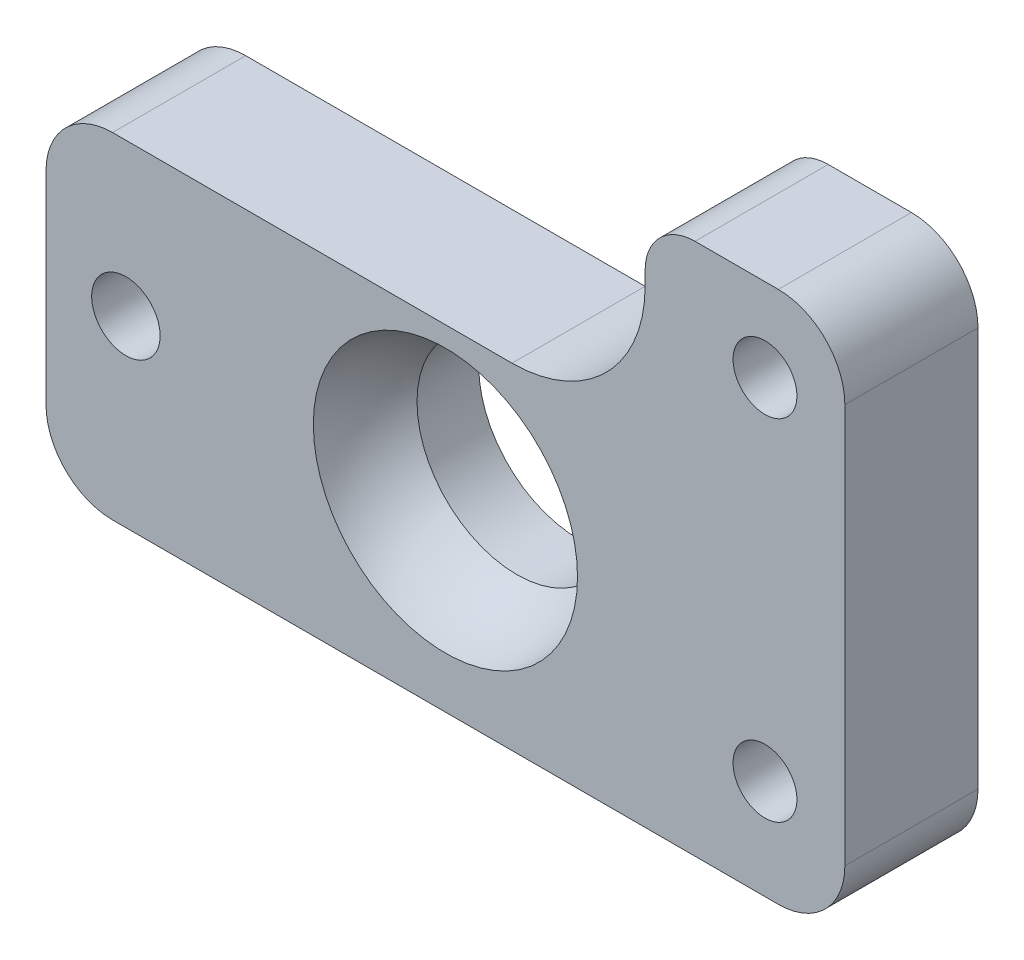
ISO-10303-21;
HEADER;
FILE_DESCRIPTION(('STEP AP214'),'2;1');
FILE_NAME('part.step','',(''),(''),'','','');
FILE_SCHEMA(('AUTOMOTIVE_DESIGN { 1 0 10303 214 1 1 1 1 }'));
ENDSEC;
DATA;
#1=APPLICATION_CONTEXT('core data for automotive mechanical design processes');
#2=APPLICATION_PROTOCOL_DEFINITION('international standard','automotive_design',2000,#1);
#3=PRODUCT_CONTEXT('',#1,'mechanical');
#4=PRODUCT('Part','Part','',(#3));
#5=PRODUCT_RELATED_PRODUCT_CATEGORY('part','',(#4));
#6=PRODUCT_DEFINITION_FORMATION('','',#4);
#7=PRODUCT_DEFINITION_CONTEXT('part definition',#1,'design');
#8=PRODUCT_DEFINITION('design','',#6,#7);
#9=PRODUCT_DEFINITION_SHAPE('','',#8);
#10=(LENGTH_UNIT() NAMED_UNIT(*) SI_UNIT(.MILLI.,.METRE.));
#11=(NAMED_UNIT(*) PLANE_ANGLE_UNIT() SI_UNIT($,.RADIAN.));
#12=(NAMED_UNIT(*) SI_UNIT($,.STERADIAN.) SOLID_ANGLE_UNIT());
#13=UNCERTAINTY_MEASURE_WITH_UNIT(LENGTH_MEASURE(1.E-05),#10,'distance_accuracy_value','');
#14=(GEOMETRIC_REPRESENTATION_CONTEXT(3) GLOBAL_UNCERTAINTY_ASSIGNED_CONTEXT((#13)) GLOBAL_UNIT_ASSIGNED_CONTEXT((#10,
#11,#12)) REPRESENTATION_CONTEXT('',''));
#15=CARTESIAN_POINT('',(0.,0.,0.));
#16=DIRECTION('',(0.,0.,1.));
#17=DIRECTION('',(1.,0.,0.));
#18=AXIS2_PLACEMENT_3D('',#15,#16,#17);
#19=CARTESIAN_POINT('',(15.875,6.12139999999998,0.));
#20=DIRECTION('',(0.,0.,1.));
#21=DIRECTION('',(1.,0.,0.));
#22=AXIS2_PLACEMENT_3D('',#19,#20,#21);
#23=PLANE('',#22);
#24=CARTESIAN_POINT('',(-15.24,11.684,0.));
#25=DIRECTION('',(0.,0.,1.));
#26=DIRECTION('',(1.,0.,0.));
#27=AXIS2_PLACEMENT_3D('',#24,#25,#26);
#28=CIRCLE('',#27,1.63195);
#29=CARTESIAN_POINT('',(-13.60805,11.684,0.));
#30=VERTEX_POINT('',#29);
#31=EDGE_CURVE('E667',#30,#30,#28,.T.);
#32=ORIENTED_EDGE('',*,*,#31,.F.);
#33=EDGE_LOOP('',(#32));
#34=FACE_BOUND('',#33,.T.);
#35=CARTESIAN_POINT('',(15.24,7.71524999999998,0.));
#36=DIRECTION('',(0.,0.,1.));
#37=DIRECTION('',(1.,0.,0.));
#38=AXIS2_PLACEMENT_3D('',#35,#36,#37);
#39=CIRCLE('',#38,1.524);
#40=CARTESIAN_POINT('',(16.764,7.71524999999998,0.));
#41=VERTEX_POINT('',#40);
#42=EDGE_CURVE('E671',#41,#41,#39,.T.);
#43=ORIENTED_EDGE('',*,*,#42,.F.);
#44=EDGE_LOOP('',(#43));
#45=FACE_BOUND('',#44,.T.);
#46=CARTESIAN_POINT('',(15.24,24.384,0.));
#47=DIRECTION('',(0.,0.,1.));
#48=DIRECTION('',(1.,0.,0.));
#49=AXIS2_PLACEMENT_3D('',#46,#47,#48);
#50=CIRCLE('',#49,1.524);
#51=CARTESIAN_POINT('',(16.764,24.384,0.));
#52=VERTEX_POINT('',#51);
#53=EDGE_CURVE('E680',#52,#52,#50,.T.);
#54=ORIENTED_EDGE('',*,*,#53,.F.);
#55=EDGE_LOOP('',(#54));
#56=FACE_BOUND('',#55,.T.);
#57=DIRECTION('',(-1.,0.,0.));
#58=VECTOR('',#57,1.);
#59=CARTESIAN_POINT('',(9.525,28.3464,0.));
#60=LINE('',#59,#58);
#61=CARTESIAN_POINT('',(15.875,28.3464,0.));
#62=VERTEX_POINT('',#61);
#63=CARTESIAN_POINT('',(11.90625,28.3464,0.));
#64=VERTEX_POINT('',#63);
#65=EDGE_CURVE('E480',#62,#64,#60,.T.);
#66=ORIENTED_EDGE('',*,*,#65,.T.);
#67=CARTESIAN_POINT('',(11.90625,25.96515,0.));
#68=DIRECTION('',(0.,0.,1.));
#69=DIRECTION('',(1.,0.,0.));
#70=AXIS2_PLACEMENT_3D('',#67,#68,#69);
#71=CIRCLE('',#70,2.38125);
#72=CARTESIAN_POINT('',(9.525,25.96515,0.));
#73=VERTEX_POINT('',#72);
#74=EDGE_CURVE('E383',#64,#73,#71,.T.);
#75=ORIENTED_EDGE('',*,*,#74,.T.);
#76=DIRECTION('',(0.,-1.,0.));
#77=VECTOR('',#76,1.);
#78=CARTESIAN_POINT('',(9.525,28.3464,0.));
#79=LINE('',#78,#77);
#80=CARTESIAN_POINT('',(9.525,25.2984,0.));
#81=VERTEX_POINT('',#80);
#82=EDGE_CURVE('E482',#73,#81,#79,.T.);
#83=ORIENTED_EDGE('',*,*,#82,.T.);
#84=CARTESIAN_POINT('',(3.175,25.2984,0.));
#85=DIRECTION('',(0.,0.,-1.));
#86=DIRECTION('',(1.,0.,0.));
#87=AXIS2_PLACEMENT_3D('',#84,#85,#86);
#88=CIRCLE('',#87,6.35);
#89=CARTESIAN_POINT('',(3.175,18.9484,0.));
#90=VERTEX_POINT('',#89);
#91=EDGE_CURVE('E484',#81,#90,#88,.T.);
#92=ORIENTED_EDGE('',*,*,#91,.T.);
#93=DIRECTION('',(-1.,0.,0.));
#94=VECTOR('',#93,1.);
#95=CARTESIAN_POINT('',(-15.875,18.9484,0.));
#96=LINE('',#95,#94);
#97=CARTESIAN_POINT('',(-15.875,18.9484,0.));
#98=VERTEX_POINT('',#97);
#99=EDGE_CURVE('E487',#90,#98,#96,.T.);
#100=ORIENTED_EDGE('',*,*,#99,.T.);
#101=CARTESIAN_POINT('',(-15.875,15.7734,0.));
#102=DIRECTION('',(0.,0.,1.));
#103=DIRECTION('',(1.,0.,0.));
#104=AXIS2_PLACEMENT_3D('',#101,#102,#103);
#105=CIRCLE('',#104,3.175);
#106=CARTESIAN_POINT('',(-19.05,15.7734,0.));
#107=VERTEX_POINT('',#106);
#108=EDGE_CURVE('E490',#98,#107,#105,.T.);
#109=ORIENTED_EDGE('',*,*,#108,.T.);
#110=DIRECTION('',(0.,-1.,0.));
#111=VECTOR('',#110,1.);
#112=CARTESIAN_POINT('',(-19.05,6.12139999999998,0.));
#113=LINE('',#112,#111);
#114=CARTESIAN_POINT('',(-19.05,6.12139999999998,0.));
#115=VERTEX_POINT('',#114);
#116=EDGE_CURVE('E493',#107,#115,#113,.T.);
#117=ORIENTED_EDGE('',*,*,#116,.T.);
#118=CARTESIAN_POINT('',(-15.875,6.12139999999998,0.));
#119=DIRECTION('',(0.,0.,1.));
#120=DIRECTION('',(1.,0.,0.));
#121=AXIS2_PLACEMENT_3D('',#118,#119,#120);
#122=CIRCLE('',#121,3.175);
#123=CARTESIAN_POINT('',(-15.875,2.94639999999998,0.));
#124=VERTEX_POINT('',#123);
#125=EDGE_CURVE('E496',#115,#124,#122,.T.);
#126=ORIENTED_EDGE('',*,*,#125,.T.);
#127=DIRECTION('',(1.,0.,0.));
#128=VECTOR('',#127,1.);
#129=CARTESIAN_POINT('',(15.875,2.94639999999998,0.));
#130=LINE('',#129,#128);
#131=CARTESIAN_POINT('',(15.875,2.94639999999998,0.));
#132=VERTEX_POINT('',#131);
#133=EDGE_CURVE('E471',#124,#132,#130,.T.);
#134=ORIENTED_EDGE('',*,*,#133,.T.);
#135=CARTESIAN_POINT('',(15.875,6.12139999999998,0.));
#136=DIRECTION('',(0.,0.,1.));
#137=DIRECTION('',(1.,0.,0.));
#138=AXIS2_PLACEMENT_3D('',#135,#136,#137);
#139=CIRCLE('',#138,3.175);
#140=CARTESIAN_POINT('',(19.05,6.12139999999998,0.));
#141=VERTEX_POINT('',#140);
#142=EDGE_CURVE('E451',#132,#141,#139,.T.);
#143=ORIENTED_EDGE('',*,*,#142,.T.);
#144=DIRECTION('',(0.,1.,0.));
#145=VECTOR('',#144,1.);
#146=CARTESIAN_POINT('',(19.05,25.1714,0.));
#147=LINE('',#146,#145);
#148=CARTESIAN_POINT('',(19.05,25.1714,0.));
#149=VERTEX_POINT('',#148);
#150=EDGE_CURVE('E462',#141,#149,#147,.T.);
#151=ORIENTED_EDGE('',*,*,#150,.T.);
#152=CARTESIAN_POINT('',(15.875,25.1714,0.));
#153=DIRECTION('',(0.,0.,1.));
#154=DIRECTION('',(1.,0.,0.));
#155=AXIS2_PLACEMENT_3D('',#152,#153,#154);
#156=CIRCLE('',#155,3.175);
#157=EDGE_CURVE('E466',#149,#62,#156,.T.);
#158=ORIENTED_EDGE('',*,*,#157,.T.);
#159=EDGE_LOOP('',(#66,#75,#83,#92,#100,#109,#117,#126,#134,#143,#151,#158));
#160=FACE_BOUND('',#159,.T.);
#161=CARTESIAN_POINT('',(0.,11.684,0.));
#162=DIRECTION('',(0.,0.,1.));
#163=DIRECTION('',(1.,0.,0.));
#164=AXIS2_PLACEMENT_3D('',#161,#162,#163);
#165=CIRCLE('',#164,6.30019530947255);
#166=CARTESIAN_POINT('',(6.30019530947255,11.684,0.));
#167=VERTEX_POINT('',#166);
#168=EDGE_CURVE('E364',#167,#167,#165,.F.);
#169=ORIENTED_EDGE('',*,*,#168,.T.);
#170=EDGE_LOOP('',(#169));
#171=FACE_BOUND('',#170,.T.);
#172=ADVANCED_FACE('F360',(#34,#45,#56,#160,#171),#23,.T.);
#173=CARTESIAN_POINT('',(15.875,6.12139999999998,-6.35));
#174=DIRECTION('',(0.,0.,1.));
#175=DIRECTION('',(1.,0.,0.));
#176=AXIS2_PLACEMENT_3D('',#173,#174,#175);
#177=CYLINDRICAL_SURFACE('',#176,3.175);
#178=ORIENTED_EDGE('',*,*,#142,.F.);
#179=DIRECTION('',(0.,0.,1.));
#180=VECTOR('',#179,1.);
#181=CARTESIAN_POINT('',(15.875,2.94639999999998,-6.35));
#182=LINE('',#181,#180);
#183=CARTESIAN_POINT('',(15.875,2.94639999999998,-6.35));
#184=VERTEX_POINT('',#183);
#185=EDGE_CURVE('E527',#184,#132,#182,.T.);
#186=ORIENTED_EDGE('',*,*,#185,.F.);
#187=CARTESIAN_POINT('',(15.875,6.12139999999998,-6.35));
#188=DIRECTION('',(0.,0.,1.));
#189=DIRECTION('',(1.,0.,0.));
#190=AXIS2_PLACEMENT_3D('',#187,#188,#189);
#191=CIRCLE('',#190,3.175);
#192=CARTESIAN_POINT('',(19.05,6.12139999999998,-6.35));
#193=VERTEX_POINT('',#192);
#194=EDGE_CURVE('E454',#184,#193,#191,.T.);
#195=ORIENTED_EDGE('',*,*,#194,.T.);
#196=DIRECTION('',(0.,0.,1.));
#197=VECTOR('',#196,1.);
#198=CARTESIAN_POINT('',(19.05,6.12139999999998,-6.35));
#199=LINE('',#198,#197);
#200=EDGE_CURVE('E448',#193,#141,#199,.T.);
#201=ORIENTED_EDGE('',*,*,#200,.T.);
#202=EDGE_LOOP('',(#178,#186,#195,#201));
#203=FACE_BOUND('',#202,.T.);
#204=ADVANCED_FACE('F362',(#203),#177,.T.);
#205=CARTESIAN_POINT('',(15.875,2.94639999999998,-6.35));
#206=DIRECTION('',(0.,-1.,0.));
#207=DIRECTION('',(1.,0.,0.));
#208=AXIS2_PLACEMENT_3D('',#205,#206,#207);
#209=PLANE('',#208);
#210=ORIENTED_EDGE('',*,*,#133,.F.);
#211=DIRECTION('',(0.,0.,1.));
#212=VECTOR('',#211,1.);
#213=CARTESIAN_POINT('',(-15.875,2.94639999999998,-6.35));
#214=LINE('',#213,#212);
#215=CARTESIAN_POINT('',(-15.875,2.94639999999998,-6.35));
#216=VERTEX_POINT('',#215);
#217=EDGE_CURVE('E530',#216,#124,#214,.T.);
#218=ORIENTED_EDGE('',*,*,#217,.F.);
#219=DIRECTION('',(1.,0.,0.));
#220=VECTOR('',#219,1.);
#221=CARTESIAN_POINT('',(15.875,2.94639999999998,-6.35));
#222=LINE('',#221,#220);
#223=EDGE_CURVE('E459',#216,#184,#222,.T.);
#224=ORIENTED_EDGE('',*,*,#223,.T.);
#225=ORIENTED_EDGE('',*,*,#185,.T.);
#226=EDGE_LOOP('',(#210,#218,#224,#225));
#227=FACE_BOUND('',#226,.T.);
#228=ADVANCED_FACE('F583',(#227),#209,.T.);
#229=CARTESIAN_POINT('',(-15.875,6.12139999999998,-6.35));
#230=DIRECTION('',(0.,0.,1.));
#231=DIRECTION('',(1.,0.,0.));
#232=AXIS2_PLACEMENT_3D('',#229,#230,#231);
#233=CYLINDRICAL_SURFACE('',#232,3.175);
#234=ORIENTED_EDGE('',*,*,#125,.F.);
#235=DIRECTION('',(0.,0.,1.));
#236=VECTOR('',#235,1.);
#237=CARTESIAN_POINT('',(-19.05,6.12139999999998,-6.35));
#238=LINE('',#237,#236);
#239=CARTESIAN_POINT('',(-19.05,6.12139999999998,-6.35));
#240=VERTEX_POINT('',#239);
#241=EDGE_CURVE('E532',#240,#115,#238,.T.);
#242=ORIENTED_EDGE('',*,*,#241,.F.);
#243=CARTESIAN_POINT('',(-15.875,6.12139999999998,-6.35));
#244=DIRECTION('',(0.,0.,1.));
#245=DIRECTION('',(1.,0.,0.));
#246=AXIS2_PLACEMENT_3D('',#243,#244,#245);
#247=CIRCLE('',#246,3.175);
#248=EDGE_CURVE('E522',#240,#216,#247,.T.);
#249=ORIENTED_EDGE('',*,*,#248,.T.);
#250=ORIENTED_EDGE('',*,*,#217,.T.);
#251=EDGE_LOOP('',(#234,#242,#249,#250));
#252=FACE_BOUND('',#251,.T.);
#253=ADVANCED_FACE('F589',(#252),#233,.T.);
#254=CARTESIAN_POINT('',(-19.05,6.12139999999998,-6.35));
#255=DIRECTION('',(-1.,0.,0.));
#256=DIRECTION('',(0.,-1.,0.));
#257=AXIS2_PLACEMENT_3D('',#254,#255,#256);
#258=PLANE('',#257);
#259=ORIENTED_EDGE('',*,*,#116,.F.);
#260=DIRECTION('',(0.,0.,1.));
#261=VECTOR('',#260,1.);
#262=CARTESIAN_POINT('',(-19.05,15.7734,-6.35));
#263=LINE('',#262,#261);
#264=CARTESIAN_POINT('',(-19.05,15.7734,-6.35));
#265=VERTEX_POINT('',#264);
#266=EDGE_CURVE('E534',#265,#107,#263,.T.);
#267=ORIENTED_EDGE('',*,*,#266,.F.);
#268=DIRECTION('',(0.,-1.,0.));
#269=VECTOR('',#268,1.);
#270=CARTESIAN_POINT('',(-19.05,6.12139999999998,-6.35));
#271=LINE('',#270,#269);
#272=EDGE_CURVE('E519',#265,#240,#271,.T.);
#273=ORIENTED_EDGE('',*,*,#272,.T.);
#274=ORIENTED_EDGE('',*,*,#241,.T.);
#275=EDGE_LOOP('',(#259,#267,#273,#274));
#276=FACE_BOUND('',#275,.T.);
#277=ADVANCED_FACE('F593',(#276),#258,.T.);
#278=CARTESIAN_POINT('',(-15.875,15.7734,-6.35));
#279=DIRECTION('',(0.,0.,1.));
#280=DIRECTION('',(1.,0.,0.));
#281=AXIS2_PLACEMENT_3D('',#278,#279,#280);
#282=CYLINDRICAL_SURFACE('',#281,3.175);
#283=ORIENTED_EDGE('',*,*,#108,.F.);
#284=DIRECTION('',(0.,0.,1.));
#285=VECTOR('',#284,1.);
#286=CARTESIAN_POINT('',(-15.875,18.9484,-6.35));
#287=LINE('',#286,#285);
#288=CARTESIAN_POINT('',(-15.875,18.9484,-6.35));
#289=VERTEX_POINT('',#288);
#290=EDGE_CURVE('E536',#289,#98,#287,.T.);
#291=ORIENTED_EDGE('',*,*,#290,.F.);
#292=CARTESIAN_POINT('',(-15.875,15.7734,-6.35));
#293=DIRECTION('',(0.,0.,1.));
#294=DIRECTION('',(1.,0.,0.));
#295=AXIS2_PLACEMENT_3D('',#292,#293,#294);
#296=CIRCLE('',#295,3.175);
#297=EDGE_CURVE('E516',#289,#265,#296,.T.);
#298=ORIENTED_EDGE('',*,*,#297,.T.);
#299=ORIENTED_EDGE('',*,*,#266,.T.);
#300=EDGE_LOOP('',(#283,#291,#298,#299));
#301=FACE_BOUND('',#300,.T.);
#302=ADVANCED_FACE('F597',(#301),#282,.T.);
#303=CARTESIAN_POINT('',(-15.875,18.9484,-6.35));
#304=DIRECTION('',(0.,1.,0.));
#305=DIRECTION('',(-1.,0.,0.));
#306=AXIS2_PLACEMENT_3D('',#303,#304,#305);
#307=PLANE('',#306);
#308=ORIENTED_EDGE('',*,*,#99,.F.);
#309=DIRECTION('',(0.,0.,1.));
#310=VECTOR('',#309,1.);
#311=CARTESIAN_POINT('',(3.175,18.9484,-6.35));
#312=LINE('',#311,#310);
#313=CARTESIAN_POINT('',(3.175,18.9484,-6.35));
#314=VERTEX_POINT('',#313);
#315=EDGE_CURVE('E538',#314,#90,#312,.T.);
#316=ORIENTED_EDGE('',*,*,#315,.F.);
#317=DIRECTION('',(-1.,0.,0.));
#318=VECTOR('',#317,1.);
#319=CARTESIAN_POINT('',(-15.875,18.9484,-6.35));
#320=LINE('',#319,#318);
#321=EDGE_CURVE('E513',#314,#289,#320,.T.);
#322=ORIENTED_EDGE('',*,*,#321,.T.);
#323=ORIENTED_EDGE('',*,*,#290,.T.);
#324=EDGE_LOOP('',(#308,#316,#322,#323));
#325=FACE_BOUND('',#324,.T.);
#326=ADVANCED_FACE('F601',(#325),#307,.T.);
#327=CARTESIAN_POINT('',(3.175,25.2984,-6.35));
#328=DIRECTION('',(0.,0.,1.));
#329=DIRECTION('',(1.,0.,0.));
#330=AXIS2_PLACEMENT_3D('',#327,#328,#329);
#331=CYLINDRICAL_SURFACE('',#330,6.35);
#332=ORIENTED_EDGE('',*,*,#91,.F.);
#333=DIRECTION('',(0.,0.,1.));
#334=VECTOR('',#333,1.);
#335=CARTESIAN_POINT('',(9.525,25.2984,-6.35));
#336=LINE('',#335,#334);
#337=CARTESIAN_POINT('',(9.525,25.2984,-6.35));
#338=VERTEX_POINT('',#337);
#339=EDGE_CURVE('E540',#338,#81,#336,.T.);
#340=ORIENTED_EDGE('',*,*,#339,.F.);
#341=CARTESIAN_POINT('',(3.175,25.2984,-6.35));
#342=DIRECTION('',(0.,0.,-1.));
#343=DIRECTION('',(1.,0.,0.));
#344=AXIS2_PLACEMENT_3D('',#341,#342,#343);
#345=CIRCLE('',#344,6.35);
#346=EDGE_CURVE('E510',#338,#314,#345,.T.);
#347=ORIENTED_EDGE('',*,*,#346,.T.);
#348=ORIENTED_EDGE('',*,*,#315,.T.);
#349=EDGE_LOOP('',(#332,#340,#347,#348));
#350=FACE_BOUND('',#349,.T.);
#351=ADVANCED_FACE('F605',(#350),#331,.F.);
#352=CARTESIAN_POINT('',(9.525,28.3464,-6.35));
#353=DIRECTION('',(-1.,0.,0.));
#354=DIRECTION('',(0.,-1.,0.));
#355=AXIS2_PLACEMENT_3D('',#352,#353,#354);
#356=PLANE('',#355);
#357=ORIENTED_EDGE('',*,*,#82,.F.);
#358=DIRECTION('',(0.,0.,1.));
#359=VECTOR('',#358,1.);
#360=CARTESIAN_POINT('',(9.525,25.96515,-6.35));
#361=LINE('',#360,#359);
#362=CARTESIAN_POINT('',(9.525,25.96515,-6.35));
#363=VERTEX_POINT('',#362);
#364=EDGE_CURVE('E369',#73,#363,#361,.F.);
#365=ORIENTED_EDGE('',*,*,#364,.T.);
#366=DIRECTION('',(0.,-1.,0.));
#367=VECTOR('',#366,1.);
#368=CARTESIAN_POINT('',(9.525,28.3464,-6.35));
#369=LINE('',#368,#367);
#370=EDGE_CURVE('E508',#363,#338,#369,.T.);
#371=ORIENTED_EDGE('',*,*,#370,.T.);
#372=ORIENTED_EDGE('',*,*,#339,.T.);
#373=EDGE_LOOP('',(#357,#365,#371,#372));
#374=FACE_BOUND('',#373,.T.);
#375=ADVANCED_FACE('F609',(#374),#356,.T.);
#376=CARTESIAN_POINT('',(9.525,28.3464,-6.35));
#377=DIRECTION('',(0.,1.,0.));
#378=DIRECTION('',(-1.,0.,0.));
#379=AXIS2_PLACEMENT_3D('',#376,#377,#378);
#380=PLANE('',#379);
#381=DIRECTION('',(-1.,0.,0.));
#382=VECTOR('',#381,1.);
#383=CARTESIAN_POINT('',(9.525,28.3464,-6.35));
#384=LINE('',#383,#382);
#385=CARTESIAN_POINT('',(15.875,28.3464,-6.35));
#386=VERTEX_POINT('',#385);
#387=CARTESIAN_POINT('',(11.90625,28.3464,-6.35));
#388=VERTEX_POINT('',#387);
#389=EDGE_CURVE('E505',#386,#388,#384,.T.);
#390=ORIENTED_EDGE('',*,*,#389,.T.);
#391=DIRECTION('',(0.,0.,1.));
#392=VECTOR('',#391,1.);
#393=CARTESIAN_POINT('',(11.90625,28.3464,-6.35));
#394=LINE('',#393,#392);
#395=EDGE_CURVE('E529',#388,#64,#394,.T.);
#396=ORIENTED_EDGE('',*,*,#395,.T.);
#397=ORIENTED_EDGE('',*,*,#65,.F.);
#398=DIRECTION('',(0.,0.,1.));
#399=VECTOR('',#398,1.);
#400=CARTESIAN_POINT('',(15.875,28.3464,-6.35));
#401=LINE('',#400,#399);
#402=EDGE_CURVE('E543',#386,#62,#401,.T.);
#403=ORIENTED_EDGE('',*,*,#402,.F.);
#404=EDGE_LOOP('',(#390,#396,#397,#403));
#405=FACE_BOUND('',#404,.T.);
#406=ADVANCED_FACE('F552',(#405),#380,.T.);
#407=CARTESIAN_POINT('',(15.875,25.1714,-6.35));
#408=DIRECTION('',(0.,0.,1.));
#409=DIRECTION('',(1.,0.,0.));
#410=AXIS2_PLACEMENT_3D('',#407,#408,#409);
#411=CYLINDRICAL_SURFACE('',#410,3.175);
#412=ORIENTED_EDGE('',*,*,#157,.F.);
#413=DIRECTION('',(0.,0.,1.));
#414=VECTOR('',#413,1.);
#415=CARTESIAN_POINT('',(19.05,25.1714,-6.35));
#416=LINE('',#415,#414);
#417=CARTESIAN_POINT('',(19.05,25.1714,-6.35));
#418=VERTEX_POINT('',#417);
#419=EDGE_CURVE('E458',#418,#149,#416,.T.);
#420=ORIENTED_EDGE('',*,*,#419,.F.);
#421=CARTESIAN_POINT('',(15.875,25.1714,-6.35));
#422=DIRECTION('',(0.,0.,1.));
#423=DIRECTION('',(1.,0.,0.));
#424=AXIS2_PLACEMENT_3D('',#421,#422,#423);
#425=CIRCLE('',#424,3.175);
#426=EDGE_CURVE('E502',#418,#386,#425,.T.);
#427=ORIENTED_EDGE('',*,*,#426,.T.);
#428=ORIENTED_EDGE('',*,*,#402,.T.);
#429=EDGE_LOOP('',(#412,#420,#427,#428));
#430=FACE_BOUND('',#429,.T.);
#431=ADVANCED_FACE('F557',(#430),#411,.T.);
#432=CARTESIAN_POINT('',(19.05,25.1714,-6.35));
#433=DIRECTION('',(1.,0.,0.));
#434=DIRECTION('',(0.,1.,0.));
#435=AXIS2_PLACEMENT_3D('',#432,#433,#434);
#436=PLANE('',#435);
#437=ORIENTED_EDGE('',*,*,#150,.F.);
#438=ORIENTED_EDGE('',*,*,#200,.F.);
#439=DIRECTION('',(0.,1.,0.));
#440=VECTOR('',#439,1.);
#441=CARTESIAN_POINT('',(19.05,25.1714,-6.35));
#442=LINE('',#441,#440);
#443=EDGE_CURVE('E500',#193,#418,#442,.T.);
#444=ORIENTED_EDGE('',*,*,#443,.T.);
#445=ORIENTED_EDGE('',*,*,#419,.T.);
#446=EDGE_LOOP('',(#437,#438,#444,#445));
#447=FACE_BOUND('',#446,.T.);
#448=ADVANCED_FACE('F463',(#447),#436,.T.);
#449=CARTESIAN_POINT('',(15.875,6.12139999999998,-6.35));
#450=DIRECTION('',(0.,0.,1.));
#451=DIRECTION('',(1.,0.,0.));
#452=AXIS2_PLACEMENT_3D('',#449,#450,#451);
#453=PLANE('',#452);
#454=CARTESIAN_POINT('',(-15.24,11.684,-6.35));
#455=DIRECTION('',(0.,0.,1.));
#456=DIRECTION('',(1.,0.,0.));
#457=AXIS2_PLACEMENT_3D('',#454,#455,#456);
#458=CIRCLE('',#457,1.63195);
#459=CARTESIAN_POINT('',(-13.60805,11.684,-6.35));
#460=VERTEX_POINT('',#459);
#461=EDGE_CURVE('E670',#460,#460,#458,.F.);
#462=ORIENTED_EDGE('',*,*,#461,.F.);
#463=EDGE_LOOP('',(#462));
#464=FACE_BOUND('',#463,.T.);
#465=CARTESIAN_POINT('',(15.24,7.71524999999998,-6.35));
#466=DIRECTION('',(0.,0.,1.));
#467=DIRECTION('',(1.,0.,0.));
#468=AXIS2_PLACEMENT_3D('',#465,#466,#467);
#469=CIRCLE('',#468,1.524);
#470=CARTESIAN_POINT('',(16.764,7.71524999999998,-6.35));
#471=VERTEX_POINT('',#470);
#472=EDGE_CURVE('E674',#471,#471,#469,.F.);
#473=ORIENTED_EDGE('',*,*,#472,.F.);
#474=EDGE_LOOP('',(#473));
#475=FACE_BOUND('',#474,.T.);
#476=CARTESIAN_POINT('',(15.24,24.384,-6.35));
#477=DIRECTION('',(0.,0.,1.));
#478=DIRECTION('',(1.,0.,0.));
#479=AXIS2_PLACEMENT_3D('',#476,#477,#478);
#480=CIRCLE('',#479,1.524);
#481=CARTESIAN_POINT('',(16.764,24.384,-6.35));
#482=VERTEX_POINT('',#481);
#483=EDGE_CURVE('E683',#482,#482,#480,.F.);
#484=ORIENTED_EDGE('',*,*,#483,.F.);
#485=EDGE_LOOP('',(#484));
#486=FACE_BOUND('',#485,.T.);
#487=CARTESIAN_POINT('',(0.,11.684,-6.35));
#488=DIRECTION('',(0.,0.,-1.));
#489=DIRECTION('',(-1.,0.,0.));
#490=AXIS2_PLACEMENT_3D('',#487,#488,#489);
#491=CIRCLE('',#490,4.7625);
#492=CARTESIAN_POINT('',(-4.7625,11.684,-6.35));
#493=VERTEX_POINT('',#492);
#494=EDGE_CURVE('E474',#493,#493,#491,.T.);
#495=ORIENTED_EDGE('',*,*,#494,.F.);
#496=EDGE_LOOP('',(#495));
#497=FACE_BOUND('',#496,.T.);
#498=ORIENTED_EDGE('',*,*,#370,.F.);
#499=CARTESIAN_POINT('',(11.90625,25.96515,-6.35));
#500=DIRECTION('',(0.,0.,1.));
#501=DIRECTION('',(1.,0.,0.));
#502=AXIS2_PLACEMENT_3D('',#499,#500,#501);
#503=CIRCLE('',#502,2.38125);
#504=EDGE_CURVE('E11',#363,#388,#503,.F.);
#505=ORIENTED_EDGE('',*,*,#504,.T.);
#506=ORIENTED_EDGE('',*,*,#389,.F.);
#507=ORIENTED_EDGE('',*,*,#426,.F.);
#508=ORIENTED_EDGE('',*,*,#443,.F.);
#509=ORIENTED_EDGE('',*,*,#194,.F.);
#510=ORIENTED_EDGE('',*,*,#223,.F.);
#511=ORIENTED_EDGE('',*,*,#248,.F.);
#512=ORIENTED_EDGE('',*,*,#272,.F.);
#513=ORIENTED_EDGE('',*,*,#297,.F.);
#514=ORIENTED_EDGE('',*,*,#321,.F.);
#515=ORIENTED_EDGE('',*,*,#346,.F.);
#516=EDGE_LOOP('',(#498,#505,#506,#507,#508,#509,#510,#511,#512,#513,#514,#515));
#517=FACE_BOUND('',#516,.T.);
#518=ADVANCED_FACE('F560',(#464,#475,#486,#497,#517),#453,.F.);
#519=CARTESIAN_POINT('',(11.90625,25.96515,-6.35));
#520=DIRECTION('',(0.,0.,1.));
#521=DIRECTION('',(1.,0.,0.));
#522=AXIS2_PLACEMENT_3D('',#519,#520,#521);
#523=CYLINDRICAL_SURFACE('',#522,2.38125);
#524=ORIENTED_EDGE('',*,*,#504,.F.);
#525=ORIENTED_EDGE('',*,*,#364,.F.);
#526=ORIENTED_EDGE('',*,*,#74,.F.);
#527=ORIENTED_EDGE('',*,*,#395,.F.);
#528=EDGE_LOOP('',(#524,#525,#526,#527));
#529=FACE_BOUND('',#528,.T.);
#530=ADVANCED_FACE('F562',(#529),#523,.T.);
#531=CARTESIAN_POINT('',(0.,11.684,0.79375));
#532=DIRECTION('',(0.,1.,0.));
#533=DIRECTION('',(0.,0.,-1.));
#534=AXIS2_PLACEMENT_3D('',#531,#532,#533);
#535=SPHERICAL_SURFACE('',#534,6.35);
#536=CARTESIAN_POINT('',(0.,11.684,0.79375));
#537=DIRECTION('',(0.,0.,1.));
#538=DIRECTION('',(1.,0.,0.));
#539=AXIS2_PLACEMENT_3D('',#536,#537,#538);
#540=SPHERICAL_SURFACE('',#539,6.35);
#541=CARTESIAN_POINT('',(0.,11.684,-3.40638020631504));
#542=DIRECTION('',(0.,0.,1.));
#543=DIRECTION('',(1.,0.,0.));
#544=AXIS2_PLACEMENT_3D('',#541,#542,#543);
#545=CIRCLE('',#544,4.7625);
#546=CARTESIAN_POINT('',(4.7625,11.684,-3.40638020631504));
#547=VERTEX_POINT('',#546);
#548=EDGE_CURVE('E476',#547,#547,#545,.F.);
#549=ORIENTED_EDGE('',*,*,#548,.T.);
#550=EDGE_LOOP('',(#549));
#551=FACE_BOUND('',#550,.T.);
#552=ORIENTED_EDGE('',*,*,#168,.F.);
#553=EDGE_LOOP('',(#552));
#554=FACE_BOUND('',#553,.T.);
#555=ADVANCED_FACE('F564',(#551,#554),#540,.F.);
#556=CARTESIAN_POINT('',(0.,11.684,0.00100000000000013));
#557=DIRECTION('',(0.,0.,-1.));
#558=DIRECTION('',(-1.,0.,0.));
#559=AXIS2_PLACEMENT_3D('',#556,#557,#558);
#560=CYLINDRICAL_SURFACE('',#559,4.7625);
#561=ORIENTED_EDGE('',*,*,#548,.F.);
#562=EDGE_LOOP('',(#561));
#563=FACE_BOUND('',#562,.T.);
#564=ORIENTED_EDGE('',*,*,#494,.T.);
#565=EDGE_LOOP('',(#564));
#566=FACE_BOUND('',#565,.T.);
#567=ADVANCED_FACE('F571',(#563,#566),#560,.F.);
#568=CARTESIAN_POINT('',(15.24,24.384,-6.351));
#569=DIRECTION('',(0.,0.,1.));
#570=DIRECTION('',(1.,0.,0.));
#571=AXIS2_PLACEMENT_3D('',#568,#569,#570);
#572=CYLINDRICAL_SURFACE('',#571,1.524);
#573=ORIENTED_EDGE('',*,*,#53,.T.);
#574=EDGE_LOOP('',(#573));
#575=FACE_BOUND('',#574,.T.);
#576=ORIENTED_EDGE('',*,*,#483,.T.);
#577=EDGE_LOOP('',(#576));
#578=FACE_BOUND('',#577,.T.);
#579=ADVANCED_FACE('F640',(#575,#578),#572,.F.);
#580=CARTESIAN_POINT('',(15.24,7.71524999999998,-6.351));
#581=DIRECTION('',(0.,0.,1.));
#582=DIRECTION('',(1.,0.,0.));
#583=AXIS2_PLACEMENT_3D('',#580,#581,#582);
#584=CYLINDRICAL_SURFACE('',#583,1.524);
#585=ORIENTED_EDGE('',*,*,#42,.T.);
#586=EDGE_LOOP('',(#585));
#587=FACE_BOUND('',#586,.T.);
#588=ORIENTED_EDGE('',*,*,#472,.T.);
#589=EDGE_LOOP('',(#588));
#590=FACE_BOUND('',#589,.T.);
#591=ADVANCED_FACE('F647',(#587,#590),#584,.F.);
#592=CARTESIAN_POINT('',(-15.24,11.684,-6.351));
#593=DIRECTION('',(0.,0.,1.));
#594=DIRECTION('',(1.,0.,0.));
#595=AXIS2_PLACEMENT_3D('',#592,#593,#594);
#596=CYLINDRICAL_SURFACE('',#595,1.63195);
#597=ORIENTED_EDGE('',*,*,#31,.T.);
#598=EDGE_LOOP('',(#597));
#599=FACE_BOUND('',#598,.T.);
#600=ORIENTED_EDGE('',*,*,#461,.T.);
#601=EDGE_LOOP('',(#600));
#602=FACE_BOUND('',#601,.T.);
#603=ADVANCED_FACE('F655',(#599,#602),#596,.F.);
#604=CLOSED_SHELL('',(#172,#204,#228,#253,#277,#302,#326,#351,#375,#406,#431,#448,#518,#530,
#555,#567,#579,#591,#603));
#605=MANIFOLD_SOLID_BREP('B2',#604);
#606=ADVANCED_BREP_SHAPE_REPRESENTATION('',(#18,#605),#14);
#607=SHAPE_DEFINITION_REPRESENTATION(#9,#606);
ENDSEC;
END-ISO-10303-21;
